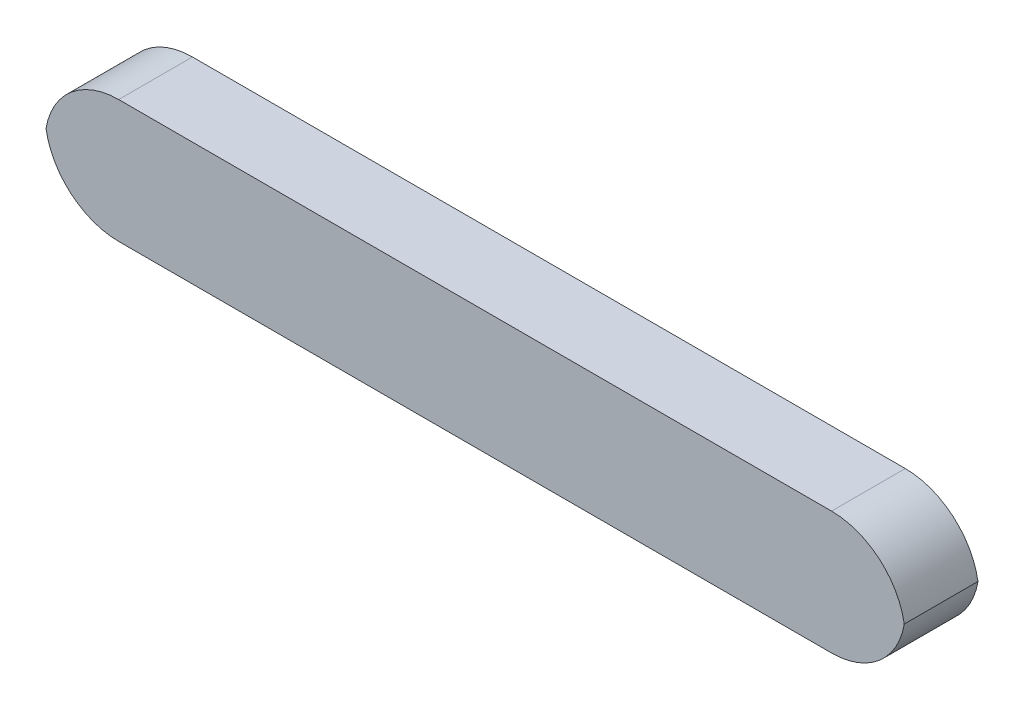
ISO-10303-21;
HEADER;
FILE_DESCRIPTION(('STEP AP214'),'2;1');
FILE_NAME('part.step','',(''),(''),'','','');
FILE_SCHEMA(('AUTOMOTIVE_DESIGN { 1 0 10303 214 1 1 1 1 }'));
ENDSEC;
DATA;
#1=APPLICATION_CONTEXT('core data for automotive mechanical design processes');
#2=APPLICATION_PROTOCOL_DEFINITION('international standard','automotive_design',2000,#1);
#3=PRODUCT_CONTEXT('',#1,'mechanical');
#4=PRODUCT('Part','Part','',(#3));
#5=PRODUCT_RELATED_PRODUCT_CATEGORY('part','',(#4));
#6=PRODUCT_DEFINITION_FORMATION('','',#4);
#7=PRODUCT_DEFINITION_CONTEXT('part definition',#1,'design');
#8=PRODUCT_DEFINITION('design','',#6,#7);
#9=PRODUCT_DEFINITION_SHAPE('','',#8);
#10=(LENGTH_UNIT() NAMED_UNIT(*) SI_UNIT(.MILLI.,.METRE.));
#11=(NAMED_UNIT(*) PLANE_ANGLE_UNIT() SI_UNIT($,.RADIAN.));
#12=(NAMED_UNIT(*) SI_UNIT($,.STERADIAN.) SOLID_ANGLE_UNIT());
#13=UNCERTAINTY_MEASURE_WITH_UNIT(LENGTH_MEASURE(1.E-05),#10,'distance_accuracy_value','');
#14=(GEOMETRIC_REPRESENTATION_CONTEXT(3) GLOBAL_UNCERTAINTY_ASSIGNED_CONTEXT((#13)) GLOBAL_UNIT_ASSIGNED_CONTEXT((#10,
#11,#12)) REPRESENTATION_CONTEXT('',''));
#15=CARTESIAN_POINT('',(0.,0.,0.));
#16=DIRECTION('',(0.,0.,1.));
#17=DIRECTION('',(1.,0.,0.));
#18=AXIS2_PLACEMENT_3D('',#15,#16,#17);
#19=CARTESIAN_POINT('',(0.,25.,30.));
#20=DIRECTION('',(0.,-1.,0.));
#21=DIRECTION('',(1.,0.,0.));
#22=AXIS2_PLACEMENT_3D('',#19,#20,#21);
#23=PLANE('',#22);
#24=DIRECTION('',(-1.,0.,0.));
#25=VECTOR('',#24,1.);
#26=CARTESIAN_POINT('',(0.,25.,0.));
#27=LINE('',#26,#25);
#28=CARTESIAN_POINT('',(145.,25.,0.));
#29=VERTEX_POINT('',#28);
#30=CARTESIAN_POINT('',(-145.,25.,0.));
#31=VERTEX_POINT('',#30);
#32=EDGE_CURVE('E128',#29,#31,#27,.T.);
#33=ORIENTED_EDGE('',*,*,#32,.T.);
#34=DIRECTION('',(0.,0.,-1.));
#35=VECTOR('',#34,1.);
#36=CARTESIAN_POINT('',(-145.,25.,30.));
#37=LINE('',#36,#35);
#38=CARTESIAN_POINT('',(-145.,25.,30.));
#39=VERTEX_POINT('',#38);
#40=EDGE_CURVE('E11',#39,#31,#37,.T.);
#41=ORIENTED_EDGE('',*,*,#40,.F.);
#42=DIRECTION('',(-1.,0.,0.));
#43=VECTOR('',#42,1.);
#44=CARTESIAN_POINT('',(0.,25.,30.));
#45=LINE('',#44,#43);
#46=CARTESIAN_POINT('',(145.,25.,30.));
#47=VERTEX_POINT('',#46);
#48=EDGE_CURVE('E146',#47,#39,#45,.T.);
#49=ORIENTED_EDGE('',*,*,#48,.F.);
#50=DIRECTION('',(0.,0.,-1.));
#51=VECTOR('',#50,1.);
#52=CARTESIAN_POINT('',(145.,25.,30.));
#53=LINE('',#52,#51);
#54=EDGE_CURVE('E124',#47,#29,#53,.T.);
#55=ORIENTED_EDGE('',*,*,#54,.T.);
#56=EDGE_LOOP('',(#33,#41,#49,#55));
#57=FACE_BOUND('',#56,.T.);
#58=ADVANCED_FACE('F41',(#57),#23,.F.);
#59=CARTESIAN_POINT('',(-145.,-5.00000000000001,30.));
#60=DIRECTION('',(0.,0.,-1.));
#61=DIRECTION('',(-1.,0.,0.));
#62=AXIS2_PLACEMENT_3D('',#59,#60,#61);
#63=CYLINDRICAL_SURFACE('',#62,30.);
#64=CARTESIAN_POINT('',(-145.,-5.00000000000001,0.));
#65=DIRECTION('',(0.,0.,1.));
#66=DIRECTION('',(1.,0.,0.));
#67=AXIS2_PLACEMENT_3D('',#64,#65,#66);
#68=CIRCLE('',#67,30.);
#69=CARTESIAN_POINT('',(-174.580398915498,0.,0.));
#70=VERTEX_POINT('',#69);
#71=EDGE_CURVE('E132',#31,#70,#68,.T.);
#72=ORIENTED_EDGE('',*,*,#71,.T.);
#73=DIRECTION('',(0.,0.,-1.));
#74=VECTOR('',#73,1.);
#75=CARTESIAN_POINT('',(-174.580398915498,0.,30.));
#76=LINE('',#75,#74);
#77=CARTESIAN_POINT('',(-174.580398915498,0.,30.));
#78=VERTEX_POINT('',#77);
#79=EDGE_CURVE('E50',#78,#70,#76,.T.);
#80=ORIENTED_EDGE('',*,*,#79,.F.);
#81=CARTESIAN_POINT('',(-145.,-5.00000000000001,30.));
#82=DIRECTION('',(0.,0.,1.));
#83=DIRECTION('',(1.,0.,0.));
#84=AXIS2_PLACEMENT_3D('',#81,#82,#83);
#85=CIRCLE('',#84,30.);
#86=EDGE_CURVE('E91',#39,#78,#85,.T.);
#87=ORIENTED_EDGE('',*,*,#86,.F.);
#88=ORIENTED_EDGE('',*,*,#40,.T.);
#89=EDGE_LOOP('',(#72,#80,#87,#88));
#90=FACE_BOUND('',#89,.T.);
#91=ADVANCED_FACE('F174',(#90),#63,.T.);
#92=CARTESIAN_POINT('',(-145.,4.99999999999998,30.));
#93=DIRECTION('',(0.,0.,-1.));
#94=DIRECTION('',(-1.,0.,0.));
#95=AXIS2_PLACEMENT_3D('',#92,#93,#94);
#96=CYLINDRICAL_SURFACE('',#95,30.);
#97=CARTESIAN_POINT('',(-145.,4.99999999999998,0.));
#98=DIRECTION('',(0.,0.,1.));
#99=DIRECTION('',(1.,0.,0.));
#100=AXIS2_PLACEMENT_3D('',#97,#98,#99);
#101=CIRCLE('',#100,30.);
#102=CARTESIAN_POINT('',(-145.,-25.,0.));
#103=VERTEX_POINT('',#102);
#104=EDGE_CURVE('E135',#70,#103,#101,.T.);
#105=ORIENTED_EDGE('',*,*,#104,.T.);
#106=DIRECTION('',(0.,0.,-1.));
#107=VECTOR('',#106,1.);
#108=CARTESIAN_POINT('',(-145.,-25.,30.));
#109=LINE('',#108,#107);
#110=CARTESIAN_POINT('',(-145.,-25.,30.));
#111=VERTEX_POINT('',#110);
#112=EDGE_CURVE('E111',#111,#103,#109,.T.);
#113=ORIENTED_EDGE('',*,*,#112,.F.);
#114=CARTESIAN_POINT('',(-145.,4.99999999999998,30.));
#115=DIRECTION('',(0.,0.,1.));
#116=DIRECTION('',(1.,0.,0.));
#117=AXIS2_PLACEMENT_3D('',#114,#115,#116);
#118=CIRCLE('',#117,30.);
#119=EDGE_CURVE('E116',#78,#111,#118,.T.);
#120=ORIENTED_EDGE('',*,*,#119,.F.);
#121=ORIENTED_EDGE('',*,*,#79,.T.);
#122=EDGE_LOOP('',(#105,#113,#120,#121));
#123=FACE_BOUND('',#122,.T.);
#124=ADVANCED_FACE('F156',(#123),#96,.T.);
#125=CARTESIAN_POINT('',(0.,-25.,30.));
#126=DIRECTION('',(0.,-1.,0.));
#127=DIRECTION('',(1.,0.,0.));
#128=AXIS2_PLACEMENT_3D('',#125,#126,#127);
#129=PLANE('',#128);
#130=DIRECTION('',(-1.,0.,0.));
#131=VECTOR('',#130,1.);
#132=CARTESIAN_POINT('',(0.,-25.,0.));
#133=LINE('',#132,#131);
#134=CARTESIAN_POINT('',(145.,-25.,0.));
#135=VERTEX_POINT('',#134);
#136=EDGE_CURVE('E105',#135,#103,#133,.T.);
#137=ORIENTED_EDGE('',*,*,#136,.F.);
#138=DIRECTION('',(0.,0.,-1.));
#139=VECTOR('',#138,1.);
#140=CARTESIAN_POINT('',(145.,-25.,30.));
#141=LINE('',#140,#139);
#142=CARTESIAN_POINT('',(145.,-25.,30.));
#143=VERTEX_POINT('',#142);
#144=EDGE_CURVE('E100',#143,#135,#141,.T.);
#145=ORIENTED_EDGE('',*,*,#144,.F.);
#146=DIRECTION('',(-1.,0.,0.));
#147=VECTOR('',#146,1.);
#148=CARTESIAN_POINT('',(0.,-25.,30.));
#149=LINE('',#148,#147);
#150=EDGE_CURVE('E103',#143,#111,#149,.T.);
#151=ORIENTED_EDGE('',*,*,#150,.T.);
#152=ORIENTED_EDGE('',*,*,#112,.T.);
#153=EDGE_LOOP('',(#137,#145,#151,#152));
#154=FACE_BOUND('',#153,.T.);
#155=ADVANCED_FACE('F102',(#154),#129,.T.);
#156=CARTESIAN_POINT('',(145.,5.00000000000002,30.));
#157=DIRECTION('',(0.,0.,-1.));
#158=DIRECTION('',(-1.,0.,0.));
#159=AXIS2_PLACEMENT_3D('',#156,#157,#158);
#160=CYLINDRICAL_SURFACE('',#159,30.);
#161=CARTESIAN_POINT('',(145.,5.00000000000002,0.));
#162=DIRECTION('',(0.,0.,1.));
#163=DIRECTION('',(1.,0.,0.));
#164=AXIS2_PLACEMENT_3D('',#161,#162,#163);
#165=CIRCLE('',#164,30.);
#166=CARTESIAN_POINT('',(174.580398915498,0.,0.));
#167=VERTEX_POINT('',#166);
#168=EDGE_CURVE('E141',#167,#135,#165,.F.);
#169=ORIENTED_EDGE('',*,*,#168,.F.);
#170=DIRECTION('',(0.,0.,-1.));
#171=VECTOR('',#170,1.);
#172=CARTESIAN_POINT('',(174.580398915498,0.,30.));
#173=LINE('',#172,#171);
#174=CARTESIAN_POINT('',(174.580398915498,0.,30.));
#175=VERTEX_POINT('',#174);
#176=EDGE_CURVE('E80',#175,#167,#173,.T.);
#177=ORIENTED_EDGE('',*,*,#176,.F.);
#178=CARTESIAN_POINT('',(145.,5.00000000000002,30.));
#179=DIRECTION('',(0.,0.,1.));
#180=DIRECTION('',(1.,0.,0.));
#181=AXIS2_PLACEMENT_3D('',#178,#179,#180);
#182=CIRCLE('',#181,30.);
#183=EDGE_CURVE('E114',#175,#143,#182,.F.);
#184=ORIENTED_EDGE('',*,*,#183,.T.);
#185=ORIENTED_EDGE('',*,*,#144,.T.);
#186=EDGE_LOOP('',(#169,#177,#184,#185));
#187=FACE_BOUND('',#186,.T.);
#188=ADVANCED_FACE('F120',(#187),#160,.T.);
#189=CARTESIAN_POINT('',(145.,-4.99999999999998,30.));
#190=DIRECTION('',(0.,0.,-1.));
#191=DIRECTION('',(-1.,0.,0.));
#192=AXIS2_PLACEMENT_3D('',#189,#190,#191);
#193=CYLINDRICAL_SURFACE('',#192,30.);
#194=CARTESIAN_POINT('',(145.,-4.99999999999998,0.));
#195=DIRECTION('',(0.,0.,1.));
#196=DIRECTION('',(1.,0.,0.));
#197=AXIS2_PLACEMENT_3D('',#194,#195,#196);
#198=CIRCLE('',#197,30.);
#199=EDGE_CURVE('E83',#167,#29,#198,.T.);
#200=ORIENTED_EDGE('',*,*,#199,.T.);
#201=ORIENTED_EDGE('',*,*,#54,.F.);
#202=CARTESIAN_POINT('',(145.,-4.99999999999998,30.));
#203=DIRECTION('',(0.,0.,1.));
#204=DIRECTION('',(1.,0.,0.));
#205=AXIS2_PLACEMENT_3D('',#202,#203,#204);
#206=CIRCLE('',#205,30.);
#207=EDGE_CURVE('E58',#175,#47,#206,.T.);
#208=ORIENTED_EDGE('',*,*,#207,.F.);
#209=ORIENTED_EDGE('',*,*,#176,.T.);
#210=EDGE_LOOP('',(#200,#201,#208,#209));
#211=FACE_BOUND('',#210,.T.);
#212=ADVANCED_FACE('F163',(#211),#193,.T.);
#213=CARTESIAN_POINT('',(0.,0.,30.));
#214=DIRECTION('',(0.,0.,1.));
#215=DIRECTION('',(1.,0.,0.));
#216=AXIS2_PLACEMENT_3D('',#213,#214,#215);
#217=PLANE('',#216);
#218=ORIENTED_EDGE('',*,*,#48,.T.);
#219=ORIENTED_EDGE('',*,*,#86,.T.);
#220=ORIENTED_EDGE('',*,*,#119,.T.);
#221=ORIENTED_EDGE('',*,*,#150,.F.);
#222=ORIENTED_EDGE('',*,*,#183,.F.);
#223=ORIENTED_EDGE('',*,*,#207,.T.);
#224=EDGE_LOOP('',(#218,#219,#220,#221,#222,#223));
#225=FACE_BOUND('',#224,.T.);
#226=ADVANCED_FACE('F113',(#225),#217,.T.);
#227=CARTESIAN_POINT('',(0.,0.,0.));
#228=DIRECTION('',(0.,0.,1.));
#229=DIRECTION('',(1.,0.,0.));
#230=AXIS2_PLACEMENT_3D('',#227,#228,#229);
#231=PLANE('',#230);
#232=ORIENTED_EDGE('',*,*,#32,.F.);
#233=ORIENTED_EDGE('',*,*,#199,.F.);
#234=ORIENTED_EDGE('',*,*,#168,.T.);
#235=ORIENTED_EDGE('',*,*,#136,.T.);
#236=ORIENTED_EDGE('',*,*,#104,.F.);
#237=ORIENTED_EDGE('',*,*,#71,.F.);
#238=EDGE_LOOP('',(#232,#233,#234,#235,#236,#237));
#239=FACE_BOUND('',#238,.T.);
#240=ADVANCED_FACE('F159',(#239),#231,.F.);
#241=CLOSED_SHELL('',(#58,#91,#124,#155,#188,#212,#226,#240));
#242=MANIFOLD_SOLID_BREP('B2',#241);
#243=ADVANCED_BREP_SHAPE_REPRESENTATION('',(#18,#242),#14);
#244=SHAPE_DEFINITION_REPRESENTATION(#9,#243);
ENDSEC;
END-ISO-10303-21;
